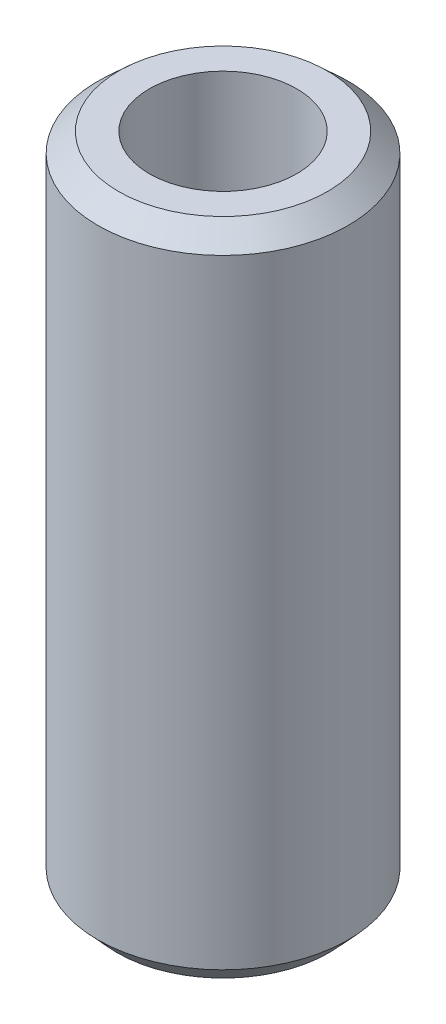
ISO-10303-21;
HEADER;
FILE_DESCRIPTION(('STEP AP214'),'2;1');
FILE_NAME('part.step','',(''),(''),'','','');
FILE_SCHEMA(('AUTOMOTIVE_DESIGN { 1 0 10303 214 1 1 1 1 }'));
ENDSEC;
DATA;
#1=APPLICATION_CONTEXT('core data for automotive mechanical design processes');
#2=APPLICATION_PROTOCOL_DEFINITION('international standard','automotive_design',2000,#1);
#3=PRODUCT_CONTEXT('',#1,'mechanical');
#4=PRODUCT('Part','Part','',(#3));
#5=PRODUCT_RELATED_PRODUCT_CATEGORY('part','',(#4));
#6=PRODUCT_DEFINITION_FORMATION('','',#4);
#7=PRODUCT_DEFINITION_CONTEXT('part definition',#1,'design');
#8=PRODUCT_DEFINITION('design','',#6,#7);
#9=PRODUCT_DEFINITION_SHAPE('','',#8);
#10=(LENGTH_UNIT() NAMED_UNIT(*) SI_UNIT(.MILLI.,.METRE.));
#11=(NAMED_UNIT(*) PLANE_ANGLE_UNIT() SI_UNIT($,.RADIAN.));
#12=(NAMED_UNIT(*) SI_UNIT($,.STERADIAN.) SOLID_ANGLE_UNIT());
#13=UNCERTAINTY_MEASURE_WITH_UNIT(LENGTH_MEASURE(1.E-05),#10,'distance_accuracy_value','');
#14=(GEOMETRIC_REPRESENTATION_CONTEXT(3) GLOBAL_UNCERTAINTY_ASSIGNED_CONTEXT((#13)) GLOBAL_UNIT_ASSIGNED_CONTEXT((#10,
#11,#12)) REPRESENTATION_CONTEXT('',''));
#15=CARTESIAN_POINT('',(0.,0.,0.));
#16=DIRECTION('',(0.,0.,1.));
#17=DIRECTION('',(1.,0.,0.));
#18=AXIS2_PLACEMENT_3D('',#15,#16,#17);
#19=CARTESIAN_POINT('',(0.,52.6283209688749,0.));
#20=DIRECTION('',(0.,-1.,0.));
#21=DIRECTION('',(0.,0.,-1.));
#22=AXIS2_PLACEMENT_3D('',#19,#20,#21);
#23=CYLINDRICAL_SURFACE('',#22,10.);
#24=CARTESIAN_POINT('',(0.,51.1029237114484,0.));
#25=DIRECTION('',(0.,1.,0.));
#26=DIRECTION('',(0.,0.,1.));
#27=AXIS2_PLACEMENT_3D('',#24,#25,#26);
#28=CIRCLE('',#27,10.);
#29=CARTESIAN_POINT('',(0.,51.1029237114484,10.));
#30=VERTEX_POINT('',#29);
#31=EDGE_CURVE('E50',#30,#30,#28,.F.);
#32=ORIENTED_EDGE('',*,*,#31,.T.);
#33=EDGE_LOOP('',(#32));
#34=FACE_BOUND('',#33,.T.);
#35=CARTESIAN_POINT('',(0.,1.65153659855701,0.));
#36=DIRECTION('',(0.,1.,0.));
#37=DIRECTION('',(0.,0.,1.));
#38=AXIS2_PLACEMENT_3D('',#35,#36,#37);
#39=CIRCLE('',#38,10.);
#40=CARTESIAN_POINT('',(0.,1.65153659855701,10.));
#41=VERTEX_POINT('',#40);
#42=EDGE_CURVE('E51',#41,#41,#39,.T.);
#43=ORIENTED_EDGE('',*,*,#42,.T.);
#44=EDGE_LOOP('',(#43));
#45=FACE_BOUND('',#44,.T.);
#46=ADVANCED_FACE('F39',(#34,#45),#23,.T.);
#47=CARTESIAN_POINT('',(0.,52.6283209688749,0.));
#48=DIRECTION('',(0.,1.,0.));
#49=DIRECTION('',(0.,0.,1.));
#50=AXIS2_PLACEMENT_3D('',#47,#48,#49);
#51=PLANE('',#50);
#52=CARTESIAN_POINT('',(0.,52.6283209688749,0.));
#53=DIRECTION('',(0.,1.,0.));
#54=DIRECTION('',(0.,0.,1.));
#55=AXIS2_PLACEMENT_3D('',#52,#53,#54);
#56=CIRCLE('',#55,8.348463401443);
#57=CARTESIAN_POINT('',(0.,52.6283209688749,8.348463401443));
#58=VERTEX_POINT('',#57);
#59=EDGE_CURVE('E54',#58,#58,#56,.T.);
#60=ORIENTED_EDGE('',*,*,#59,.T.);
#61=EDGE_LOOP('',(#60));
#62=FACE_BOUND('',#61,.T.);
#63=CARTESIAN_POINT('',(0.,52.6283209688749,0.));
#64=DIRECTION('',(0.,1.,0.));
#65=DIRECTION('',(0.,0.,1.));
#66=AXIS2_PLACEMENT_3D('',#63,#64,#65);
#67=CIRCLE('',#66,5.88999035684465);
#68=CARTESIAN_POINT('',(0.,52.6283209688749,5.88999035684465));
#69=VERTEX_POINT('',#68);
#70=EDGE_CURVE('E58',#69,#69,#67,.T.);
#71=ORIENTED_EDGE('',*,*,#70,.F.);
#72=EDGE_LOOP('',(#71));
#73=FACE_BOUND('',#72,.T.);
#74=ADVANCED_FACE('F69',(#62,#73),#51,.T.);
#75=CARTESIAN_POINT('',(0.,0.,0.));
#76=DIRECTION('',(0.,1.,0.));
#77=DIRECTION('',(0.,0.,1.));
#78=AXIS2_PLACEMENT_3D('',#75,#76,#77);
#79=PLANE('',#78);
#80=CARTESIAN_POINT('',(0.,0.,0.));
#81=DIRECTION('',(0.,1.,0.));
#82=DIRECTION('',(0.,0.,1.));
#83=AXIS2_PLACEMENT_3D('',#80,#81,#82);
#84=CIRCLE('',#83,8.47460274257349);
#85=CARTESIAN_POINT('',(0.,0.,8.47460274257349));
#86=VERTEX_POINT('',#85);
#87=EDGE_CURVE('E10',#86,#86,#84,.F.);
#88=ORIENTED_EDGE('',*,*,#87,.T.);
#89=EDGE_LOOP('',(#88));
#90=FACE_BOUND('',#89,.T.);
#91=CARTESIAN_POINT('',(0.,0.,0.));
#92=DIRECTION('',(0.,1.,0.));
#93=DIRECTION('',(0.,0.,1.));
#94=AXIS2_PLACEMENT_3D('',#91,#92,#93);
#95=CIRCLE('',#94,5.88999035684465);
#96=CARTESIAN_POINT('',(0.,0.,5.88999035684465));
#97=VERTEX_POINT('',#96);
#98=EDGE_CURVE('E63',#97,#97,#95,.T.);
#99=ORIENTED_EDGE('',*,*,#98,.T.);
#100=EDGE_LOOP('',(#99));
#101=FACE_BOUND('',#100,.T.);
#102=ADVANCED_FACE('F75',(#90,#101),#79,.F.);
#103=CARTESIAN_POINT('',(0.,52.6283209688749,0.));
#104=DIRECTION('',(0.,-1.,0.));
#105=DIRECTION('',(0.,0.,-1.));
#106=AXIS2_PLACEMENT_3D('',#103,#104,#105);
#107=CYLINDRICAL_SURFACE('',#106,5.88999035684465);
#108=ORIENTED_EDGE('',*,*,#70,.T.);
#109=EDGE_LOOP('',(#108));
#110=FACE_BOUND('',#109,.T.);
#111=ORIENTED_EDGE('',*,*,#98,.F.);
#112=EDGE_LOOP('',(#111));
#113=FACE_BOUND('',#112,.T.);
#114=ADVANCED_FACE('F70',(#110,#113),#107,.F.);
#115=CARTESIAN_POINT('',(0.,52.6283209688749,0.));
#116=DIRECTION('',(0.,-1.,0.));
#117=DIRECTION('',(0.,0.,-1.));
#118=AXIS2_PLACEMENT_3D('',#115,#116,#117);
#119=CONICAL_SURFACE('',#118,8.348463401443,0.825082061348646);
#120=ORIENTED_EDGE('',*,*,#31,.F.);
#121=EDGE_LOOP('',(#120));
#122=FACE_BOUND('',#121,.T.);
#123=ORIENTED_EDGE('',*,*,#59,.F.);
#124=EDGE_LOOP('',(#123));
#125=FACE_BOUND('',#124,.T.);
#126=ADVANCED_FACE('F81',(#122,#125),#119,.T.);
#127=CARTESIAN_POINT('',(0.,1.65153659855701,0.));
#128=DIRECTION('',(0.,1.,0.));
#129=DIRECTION('',(0.,0.,1.));
#130=AXIS2_PLACEMENT_3D('',#127,#128,#129);
#131=CONICAL_SURFACE('',#130,10.,0.74571426544625);
#132=CARTESIAN_POINT('',(0.,0.,8.47460274257349));
#133=CARTESIAN_POINT('',(0.,0.0172035062349686,8.49049229733835));
#134=CARTESIAN_POINT('',(0.,0.0344070124699375,8.50638185210321));
#135=CARTESIAN_POINT('',(0.,0.0688140249398753,8.53816096163292));
#136=CARTESIAN_POINT('',(0.,0.0860175311748441,8.55405051639779));
#137=CARTESIAN_POINT('',(0.,0.120424543644782,8.5858296259275));
#138=CARTESIAN_POINT('',(0.,0.137628049879751,8.60171918069236));
#139=CARTESIAN_POINT('',(0.,0.172035062349688,8.63349829022208));
#140=CARTESIAN_POINT('',(0.,0.189238568584657,8.64938784498694));
#141=CARTESIAN_POINT('',(0.,0.223645581054595,8.68116695451666));
#142=CARTESIAN_POINT('',(0.,0.240849087289564,8.69705650928152));
#143=CARTESIAN_POINT('',(0.,0.275256099759502,8.72883561881124));
#144=CARTESIAN_POINT('',(0.,0.292459605994471,8.7447251735761));
#145=CARTESIAN_POINT('',(0.,0.326866618464408,8.77650428310582));
#146=CARTESIAN_POINT('',(0.,0.344070124699377,8.79239383787068));
#147=CARTESIAN_POINT('',(0.,0.378477137169315,8.82417294740039));
#148=CARTESIAN_POINT('',(0.,0.395680643404284,8.84006250216525));
#149=CARTESIAN_POINT('',(0.,0.430087655874222,8.87184161169497));
#150=CARTESIAN_POINT('',(0.,0.44729116210919,8.88773116645983));
#151=CARTESIAN_POINT('',(0.,0.481698174579128,8.91951027598955));
#152=CARTESIAN_POINT('',(0.,0.498901680814097,8.93539983075441));
#153=CARTESIAN_POINT('',(0.,0.533308693284035,8.96717894028413));
#154=CARTESIAN_POINT('',(0.,0.550512199519004,8.98306849504899));
#155=CARTESIAN_POINT('',(0.,0.584919211988941,9.01484760457871));
#156=CARTESIAN_POINT('',(0.,0.60212271822391,9.03073715934357));
#157=CARTESIAN_POINT('',(0.,0.636529730693848,9.06251626887329));
#158=CARTESIAN_POINT('',(0.,0.653733236928817,9.07840582363815));
#159=CARTESIAN_POINT('',(0.,0.688140249398755,9.11018493316787));
#160=CARTESIAN_POINT('',(0.,0.705343755633724,9.12607448793273));
#161=CARTESIAN_POINT('',(0.,0.739750768103661,9.15785359746245));
#162=CARTESIAN_POINT('',(0.,0.75695427433863,9.1737431522273));
#163=CARTESIAN_POINT('',(0.,0.791361286808568,9.20552226175702));
#164=CARTESIAN_POINT('',(0.,0.808564793043537,9.22141181652188));
#165=CARTESIAN_POINT('',(0.,0.842971805513475,9.2531909260516));
#166=CARTESIAN_POINT('',(0.,0.860175311748444,9.26908048081646));
#167=CARTESIAN_POINT('',(0.,0.894582324218381,9.30085959034618));
#168=CARTESIAN_POINT('',(0.,0.91178583045335,9.31674914511104));
#169=CARTESIAN_POINT('',(0.,0.946192842923288,9.34852825464076));
#170=CARTESIAN_POINT('',(0.,0.963396349158256,9.36441780940562));
#171=CARTESIAN_POINT('',(0.,0.997803361628194,9.39619691893534));
#172=CARTESIAN_POINT('',(0.,1.01500686786316,9.4120864737002));
#173=CARTESIAN_POINT('',(0.,1.0494138803331,9.44386558322992));
#174=CARTESIAN_POINT('',(0.,1.06661738656807,9.45975513799478));
#175=CARTESIAN_POINT('',(0.,1.10102439903801,9.49153424752449));
#176=CARTESIAN_POINT('',(0.,1.11822790527298,9.50742380228936));
#177=CARTESIAN_POINT('',(0.,1.15263491774291,9.53920291181907));
#178=CARTESIAN_POINT('',(0.,1.16983842397788,9.55509246658393));
#179=CARTESIAN_POINT('',(0.,1.20424543644782,9.58687157611365));
#180=CARTESIAN_POINT('',(0.,1.22144894268279,9.60276113087851));
#181=CARTESIAN_POINT('',(0.,1.25585595515273,9.63454024040823));
#182=CARTESIAN_POINT('',(0.,1.2730594613877,9.65042979517309));
#183=CARTESIAN_POINT('',(0.,1.30746647385763,9.68220890470281));
#184=CARTESIAN_POINT('',(0.,1.3246699800926,9.69809845946767));
#185=CARTESIAN_POINT('',(0.,1.35907699256254,9.72987756899739));
#186=CARTESIAN_POINT('',(0.,1.37628049879751,9.74576712376225));
#187=CARTESIAN_POINT('',(0.,1.41068751126745,9.77754623329197));
#188=CARTESIAN_POINT('',(0.,1.42789101750242,9.79343578805683));
#189=CARTESIAN_POINT('',(0.,1.46229802997235,9.82521489758655));
#190=CARTESIAN_POINT('',(0.,1.47950153620732,9.84110445235141));
#191=CARTESIAN_POINT('',(0.,1.51390854867726,9.87288356188112));
#192=CARTESIAN_POINT('',(0.,1.53111205491223,9.88877311664598));
#193=CARTESIAN_POINT('',(0.,1.56551906738217,9.9205522261757));
#194=CARTESIAN_POINT('',(0.,1.58272257361714,9.93644178094056));
#195=CARTESIAN_POINT('',(0.,1.61712958608707,9.96822089047028));
#196=CARTESIAN_POINT('',(0.,1.63433309232204,9.98411044523514));
#197=CARTESIAN_POINT('',(0.,1.65153659855701,10.));
#198=B_SPLINE_CURVE_WITH_KNOTS('',3,(#132,#133,#134,#135,#136,#137,#138,#139,#140,#141,#142,
#143,#144,#145,#146,#147,#148,#149,#150,#151,#152,#153,#154,#155,#156,#157,#158,#159,#160,#161,
#162,#163,#164,#165,#166,#167,#168,#169,#170,#171,#172,#173,#174,#175,#176,#177,#178,#179,#180,
#181,#182,#183,#184,#185,#186,#187,#188,#189,#190,#191,#192,#193,#194,#195,#196,#197),
.UNSPECIFIED.,.F.,.F.,(4,2,2,2,2,2,2,2,2,2,2,2,2,2,2,2,2,2,2,2,2,2,2,2,2,2,2,2,2,2,2,2,4),(0.,
0.0702562964909105,0.140512592981821,0.210768889472732,0.281025185963642,0.351281482454553,
0.421537778945463,0.491794075436374,0.562050371927284,0.632306668418196,0.702562964909107,
0.772819261400017,0.843075557890928,0.913331854381838,0.983588150872749,1.05384444736366,
1.12410074385457,1.19435704034548,1.26461333683639,1.3348696333273,1.40512592981821,
1.47538222630912,1.54563852280003,1.61589481929094,1.68615111578186,1.75640741227277,
1.82666370876368,1.89692000525459,1.9671763017455,2.03743259823641,2.10768889472732,
2.17794519121823,2.24820148770914),.UNSPECIFIED.);
#199=EDGE_CURVE('BSEAM45',#86,#41,#198,.T.);
#200=ORIENTED_EDGE('',*,*,#87,.F.);
#201=ORIENTED_EDGE('',*,*,#42,.F.);
#202=ORIENTED_EDGE('',*,*,#199,.T.);
#203=ORIENTED_EDGE('',*,*,#199,.F.);
#204=EDGE_LOOP('',(#200,#202,#201,#203));
#205=FACE_BOUND('',#204,.T.);
#206=ADVANCED_FACE('F45',(#205),#131,.T.);
#207=CLOSED_SHELL('',(#46,#74,#102,#114,#126,#206));
#208=MANIFOLD_SOLID_BREP('B2',#207);
#209=ADVANCED_BREP_SHAPE_REPRESENTATION('',(#18,#208),#14);
#210=SHAPE_DEFINITION_REPRESENTATION(#9,#209);
ENDSEC;
END-ISO-10303-21;
